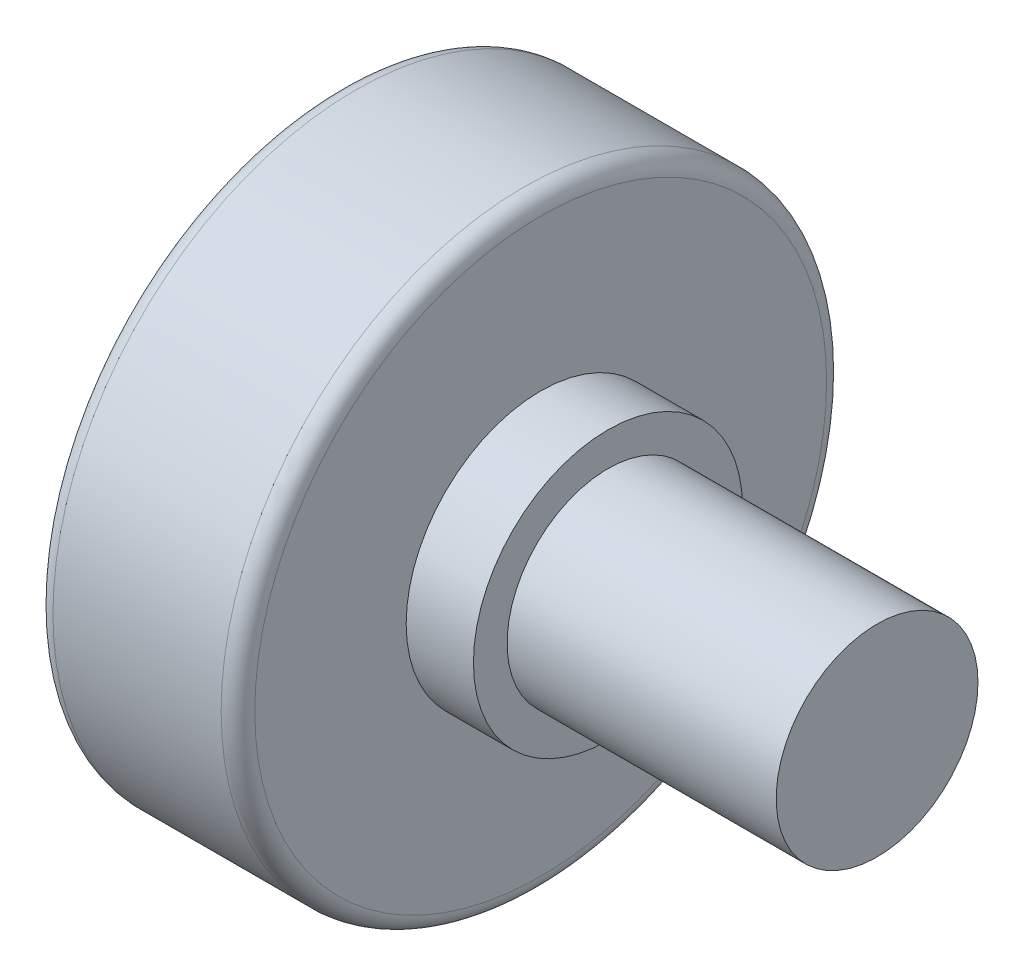
ISO-10303-21;
HEADER;
FILE_DESCRIPTION(('STEP AP214'),'2;1');
FILE_NAME('part.step','',(''),(''),'','','');
FILE_SCHEMA(('AUTOMOTIVE_DESIGN { 1 0 10303 214 1 1 1 1 }'));
ENDSEC;
DATA;
#1=APPLICATION_CONTEXT('core data for automotive mechanical design processes');
#2=APPLICATION_PROTOCOL_DEFINITION('international standard','automotive_design',2000,#1);
#3=PRODUCT_CONTEXT('',#1,'mechanical');
#4=PRODUCT('Part','Part','',(#3));
#5=PRODUCT_RELATED_PRODUCT_CATEGORY('part','',(#4));
#6=PRODUCT_DEFINITION_FORMATION('','',#4);
#7=PRODUCT_DEFINITION_CONTEXT('part definition',#1,'design');
#8=PRODUCT_DEFINITION('design','',#6,#7);
#9=PRODUCT_DEFINITION_SHAPE('','',#8);
#10=(LENGTH_UNIT() NAMED_UNIT(*) SI_UNIT(.MILLI.,.METRE.));
#11=(NAMED_UNIT(*) PLANE_ANGLE_UNIT() SI_UNIT($,.RADIAN.));
#12=(NAMED_UNIT(*) SI_UNIT($,.STERADIAN.) SOLID_ANGLE_UNIT());
#13=UNCERTAINTY_MEASURE_WITH_UNIT(LENGTH_MEASURE(1.E-05),#10,'distance_accuracy_value','');
#14=(GEOMETRIC_REPRESENTATION_CONTEXT(3) GLOBAL_UNCERTAINTY_ASSIGNED_CONTEXT((#13)) GLOBAL_UNIT_ASSIGNED_CONTEXT((#10,
#11,#12)) REPRESENTATION_CONTEXT('',''));
#15=CARTESIAN_POINT('',(0.,0.,0.));
#16=DIRECTION('',(0.,0.,1.));
#17=DIRECTION('',(1.,0.,0.));
#18=AXIS2_PLACEMENT_3D('',#15,#16,#17);
#19=CARTESIAN_POINT('',(0.,0.,0.));
#20=DIRECTION('',(1.,0.,0.));
#21=DIRECTION('',(0.,0.,-1.));
#22=AXIS2_PLACEMENT_3D('',#19,#20,#21);
#23=PLANE('',#22);
#24=CARTESIAN_POINT('',(0.,0.,0.));
#25=DIRECTION('',(1.,0.,0.));
#26=DIRECTION('',(0.,0.,-1.));
#27=AXIS2_PLACEMENT_3D('',#24,#25,#26);
#28=CIRCLE('',#27,8.49999999999999);
#29=CARTESIAN_POINT('',(0.,0.,-8.49999999999999));
#30=VERTEX_POINT('',#29);
#31=EDGE_CURVE('E10',#30,#30,#28,.T.);
#32=ORIENTED_EDGE('',*,*,#31,.F.);
#33=EDGE_LOOP('',(#32));
#34=FACE_BOUND('',#33,.T.);
#35=ADVANCED_FACE('F35',(#34),#23,.F.);
#36=CARTESIAN_POINT('',(0.500000000000001,0.,0.));
#37=DIRECTION('',(1.,0.,0.));
#38=DIRECTION('',(0.,0.,-1.));
#39=AXIS2_PLACEMENT_3D('',#36,#37,#38);
#40=TOROIDAL_SURFACE('',#39,8.5,0.5);
#41=CARTESIAN_POINT('',(0.5,0.,0.));
#42=DIRECTION('',(1.,0.,0.));
#43=DIRECTION('',(0.,0.,-1.));
#44=AXIS2_PLACEMENT_3D('',#41,#42,#43);
#45=CIRCLE('',#44,9.);
#46=CARTESIAN_POINT('',(0.5,0.,-9.));
#47=VERTEX_POINT('',#46);
#48=EDGE_CURVE('E41',#47,#47,#45,.T.);
#49=ORIENTED_EDGE('',*,*,#48,.F.);
#50=EDGE_LOOP('',(#49));
#51=FACE_BOUND('',#50,.T.);
#52=ORIENTED_EDGE('',*,*,#31,.T.);
#53=EDGE_LOOP('',(#52));
#54=FACE_BOUND('',#53,.T.);
#55=ADVANCED_FACE('F101',(#51,#54),#40,.T.);
#56=CARTESIAN_POINT('',(16.,0.,0.));
#57=DIRECTION('',(1.,0.,0.));
#58=DIRECTION('',(0.,0.,-1.));
#59=AXIS2_PLACEMENT_3D('',#56,#57,#58);
#60=CYLINDRICAL_SURFACE('',#59,9.);
#61=CARTESIAN_POINT('',(5.5,0.,0.));
#62=DIRECTION('',(1.,0.,0.));
#63=DIRECTION('',(0.,0.,-1.));
#64=AXIS2_PLACEMENT_3D('',#61,#62,#63);
#65=CIRCLE('',#64,9.);
#66=CARTESIAN_POINT('',(5.5,0.,-9.));
#67=VERTEX_POINT('',#66);
#68=EDGE_CURVE('E45',#67,#67,#65,.T.);
#69=ORIENTED_EDGE('',*,*,#68,.F.);
#70=EDGE_LOOP('',(#69));
#71=FACE_BOUND('',#70,.T.);
#72=ORIENTED_EDGE('',*,*,#48,.T.);
#73=EDGE_LOOP('',(#72));
#74=FACE_BOUND('',#73,.T.);
#75=ADVANCED_FACE('F96',(#71,#74),#60,.T.);
#76=CARTESIAN_POINT('',(5.5,0.,0.));
#77=DIRECTION('',(1.,0.,0.));
#78=DIRECTION('',(0.,0.,-1.));
#79=AXIS2_PLACEMENT_3D('',#76,#77,#78);
#80=TOROIDAL_SURFACE('',#79,8.5,0.5);
#81=CARTESIAN_POINT('',(6.,0.,0.));
#82=DIRECTION('',(1.,0.,0.));
#83=DIRECTION('',(0.,0.,-1.));
#84=AXIS2_PLACEMENT_3D('',#81,#82,#83);
#85=CIRCLE('',#84,8.49999999999999);
#86=CARTESIAN_POINT('',(6.,0.,-8.49999999999999));
#87=VERTEX_POINT('',#86);
#88=EDGE_CURVE('E49',#87,#87,#85,.T.);
#89=ORIENTED_EDGE('',*,*,#88,.F.);
#90=EDGE_LOOP('',(#89));
#91=FACE_BOUND('',#90,.T.);
#92=ORIENTED_EDGE('',*,*,#68,.T.);
#93=EDGE_LOOP('',(#92));
#94=FACE_BOUND('',#93,.T.);
#95=ADVANCED_FACE('F90',(#91,#94),#80,.T.);
#96=CARTESIAN_POINT('',(6.,0.,8.49999999999999));
#97=DIRECTION('',(-1.,0.,0.));
#98=DIRECTION('',(0.,0.,1.));
#99=AXIS2_PLACEMENT_3D('',#96,#97,#98);
#100=PLANE('',#99);
#101=CARTESIAN_POINT('',(6.,0.,0.));
#102=DIRECTION('',(1.,0.,0.));
#103=DIRECTION('',(0.,0.,-1.));
#104=AXIS2_PLACEMENT_3D('',#101,#102,#103);
#105=CIRCLE('',#104,4.);
#106=CARTESIAN_POINT('',(6.,0.,-4.));
#107=VERTEX_POINT('',#106);
#108=EDGE_CURVE('E54',#107,#107,#105,.T.);
#109=ORIENTED_EDGE('',*,*,#108,.F.);
#110=EDGE_LOOP('',(#109));
#111=FACE_BOUND('',#110,.T.);
#112=ORIENTED_EDGE('',*,*,#88,.T.);
#113=EDGE_LOOP('',(#112));
#114=FACE_BOUND('',#113,.T.);
#115=ADVANCED_FACE('F84',(#111,#114),#100,.F.);
#116=CARTESIAN_POINT('',(16.,0.,0.));
#117=DIRECTION('',(1.,0.,0.));
#118=DIRECTION('',(0.,0.,-1.));
#119=AXIS2_PLACEMENT_3D('',#116,#117,#118);
#120=CYLINDRICAL_SURFACE('',#119,4.);
#121=CARTESIAN_POINT('',(8.,0.,0.));
#122=DIRECTION('',(1.,0.,0.));
#123=DIRECTION('',(0.,0.,-1.));
#124=AXIS2_PLACEMENT_3D('',#121,#122,#123);
#125=CIRCLE('',#124,4.);
#126=CARTESIAN_POINT('',(8.,0.,-4.));
#127=VERTEX_POINT('',#126);
#128=EDGE_CURVE('E57',#127,#127,#125,.T.);
#129=ORIENTED_EDGE('',*,*,#128,.F.);
#130=EDGE_LOOP('',(#129));
#131=FACE_BOUND('',#130,.T.);
#132=ORIENTED_EDGE('',*,*,#108,.T.);
#133=EDGE_LOOP('',(#132));
#134=FACE_BOUND('',#133,.T.);
#135=ADVANCED_FACE('F78',(#131,#134),#120,.T.);
#136=CARTESIAN_POINT('',(8.,0.,4.));
#137=DIRECTION('',(-1.,0.,0.));
#138=DIRECTION('',(0.,0.,1.));
#139=AXIS2_PLACEMENT_3D('',#136,#137,#138);
#140=PLANE('',#139);
#141=CARTESIAN_POINT('',(8.,0.,0.));
#142=DIRECTION('',(1.,0.,0.));
#143=DIRECTION('',(0.,0.,-1.));
#144=AXIS2_PLACEMENT_3D('',#141,#142,#143);
#145=CIRCLE('',#144,3.);
#146=CARTESIAN_POINT('',(8.,0.,-3.));
#147=VERTEX_POINT('',#146);
#148=EDGE_CURVE('E60',#147,#147,#145,.T.);
#149=ORIENTED_EDGE('',*,*,#148,.F.);
#150=EDGE_LOOP('',(#149));
#151=FACE_BOUND('',#150,.T.);
#152=ORIENTED_EDGE('',*,*,#128,.T.);
#153=EDGE_LOOP('',(#152));
#154=FACE_BOUND('',#153,.T.);
#155=ADVANCED_FACE('F72',(#151,#154),#140,.F.);
#156=CARTESIAN_POINT('',(16.,0.,0.));
#157=DIRECTION('',(1.,0.,0.));
#158=DIRECTION('',(0.,0.,-1.));
#159=AXIS2_PLACEMENT_3D('',#156,#157,#158);
#160=CYLINDRICAL_SURFACE('',#159,3.);
#161=CARTESIAN_POINT('',(16.,0.,0.));
#162=DIRECTION('',(1.,0.,0.));
#163=DIRECTION('',(0.,0.,-1.));
#164=AXIS2_PLACEMENT_3D('',#161,#162,#163);
#165=CIRCLE('',#164,3.);
#166=CARTESIAN_POINT('',(16.,0.,-3.));
#167=VERTEX_POINT('',#166);
#168=EDGE_CURVE('E63',#167,#167,#165,.T.);
#169=ORIENTED_EDGE('',*,*,#168,.F.);
#170=EDGE_LOOP('',(#169));
#171=FACE_BOUND('',#170,.T.);
#172=ORIENTED_EDGE('',*,*,#148,.T.);
#173=EDGE_LOOP('',(#172));
#174=FACE_BOUND('',#173,.T.);
#175=ADVANCED_FACE('F69',(#171,#174),#160,.T.);
#176=CARTESIAN_POINT('',(16.,0.,3.));
#177=DIRECTION('',(-1.,0.,0.));
#178=DIRECTION('',(0.,0.,1.));
#179=AXIS2_PLACEMENT_3D('',#176,#177,#178);
#180=PLANE('',#179);
#181=ORIENTED_EDGE('',*,*,#168,.T.);
#182=EDGE_LOOP('',(#181));
#183=FACE_BOUND('',#182,.T.);
#184=ADVANCED_FACE('F67',(#183),#180,.F.);
#185=CLOSED_SHELL('',(#35,#55,#75,#95,#115,#135,#155,#175,#184));
#186=MANIFOLD_SOLID_BREP('B2',#185);
#187=ADVANCED_BREP_SHAPE_REPRESENTATION('',(#18,#186),#14);
#188=SHAPE_DEFINITION_REPRESENTATION(#9,#187);
ENDSEC;
END-ISO-10303-21;
